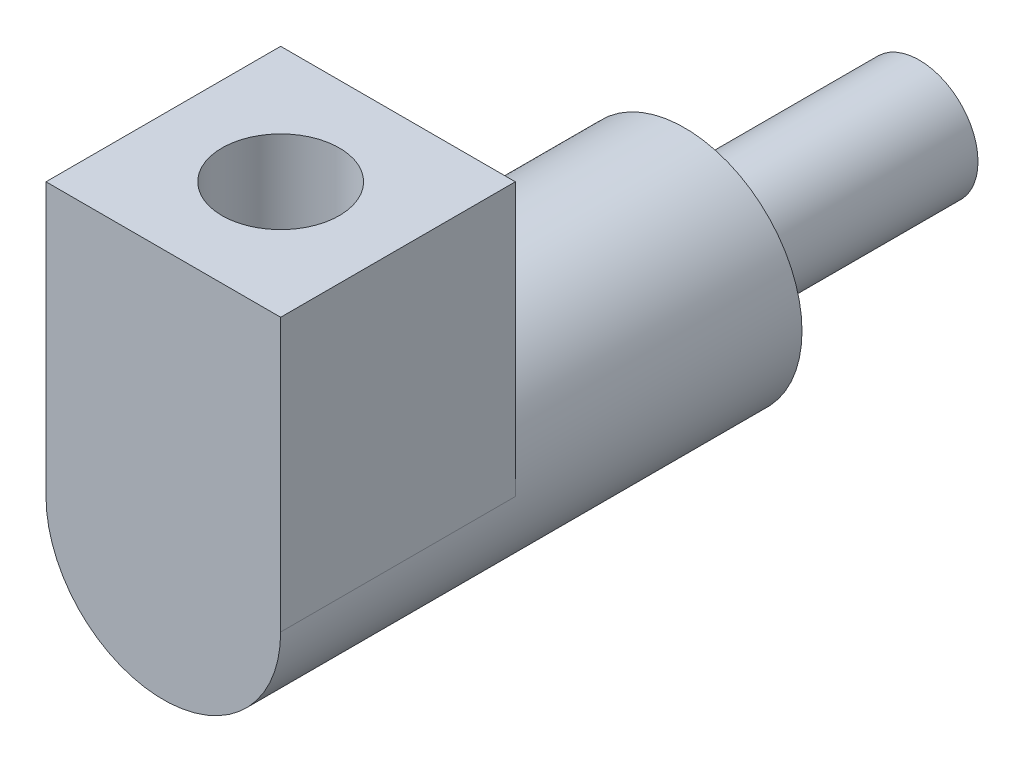
ISO-10303-21;
HEADER;
FILE_DESCRIPTION(('STEP AP214'),'2;1');
FILE_NAME('part.step','',(''),(''),'','','');
FILE_SCHEMA(('AUTOMOTIVE_DESIGN { 1 0 10303 214 1 1 1 1 }'));
ENDSEC;
DATA;
#1=APPLICATION_CONTEXT('core data for automotive mechanical design processes');
#2=APPLICATION_PROTOCOL_DEFINITION('international standard','automotive_design',2000,#1);
#3=PRODUCT_CONTEXT('',#1,'mechanical');
#4=PRODUCT('Part','Part','',(#3));
#5=PRODUCT_RELATED_PRODUCT_CATEGORY('part','',(#4));
#6=PRODUCT_DEFINITION_FORMATION('','',#4);
#7=PRODUCT_DEFINITION_CONTEXT('part definition',#1,'design');
#8=PRODUCT_DEFINITION('design','',#6,#7);
#9=PRODUCT_DEFINITION_SHAPE('','',#8);
#10=(LENGTH_UNIT() NAMED_UNIT(*) SI_UNIT(.MILLI.,.METRE.));
#11=(NAMED_UNIT(*) PLANE_ANGLE_UNIT() SI_UNIT($,.RADIAN.));
#12=(NAMED_UNIT(*) SI_UNIT($,.STERADIAN.) SOLID_ANGLE_UNIT());
#13=UNCERTAINTY_MEASURE_WITH_UNIT(LENGTH_MEASURE(1.E-05),#10,'distance_accuracy_value','');
#14=(GEOMETRIC_REPRESENTATION_CONTEXT(3) GLOBAL_UNCERTAINTY_ASSIGNED_CONTEXT((#13)) GLOBAL_UNIT_ASSIGNED_CONTEXT((#10,
#11,#12)) REPRESENTATION_CONTEXT('',''));
#15=CARTESIAN_POINT('',(0.,0.,0.));
#16=DIRECTION('',(0.,0.,1.));
#17=DIRECTION('',(1.,0.,0.));
#18=AXIS2_PLACEMENT_3D('',#15,#16,#17);
#19=CARTESIAN_POINT('',(0.,0.,30.));
#20=DIRECTION('',(0.,0.,-1.));
#21=DIRECTION('',(-1.,0.,0.));
#22=AXIS2_PLACEMENT_3D('',#19,#20,#21);
#23=CYLINDRICAL_SURFACE('',#22,15.);
#24=CARTESIAN_POINT('',(0.,0.,30.));
#25=DIRECTION('',(0.,0.,1.));
#26=DIRECTION('',(1.,0.,0.));
#27=AXIS2_PLACEMENT_3D('',#24,#25,#26);
#28=CIRCLE('',#27,15.);
#29=CARTESIAN_POINT('',(15.,0.,30.));
#30=VERTEX_POINT('',#29);
#31=EDGE_CURVE('E11',#30,#30,#28,.T.);
#32=ORIENTED_EDGE('',*,*,#31,.F.);
#33=EDGE_LOOP('',(#32));
#34=FACE_BOUND('',#33,.T.);
#35=CARTESIAN_POINT('',(0.,0.,-30.));
#36=DIRECTION('',(0.,0.,1.));
#37=DIRECTION('',(1.,0.,0.));
#38=AXIS2_PLACEMENT_3D('',#35,#36,#37);
#39=CIRCLE('',#38,15.);
#40=CARTESIAN_POINT('',(15.,0.,-30.));
#41=VERTEX_POINT('',#40);
#42=EDGE_CURVE('E37',#41,#41,#39,.T.);
#43=ORIENTED_EDGE('',*,*,#42,.T.);
#44=EDGE_LOOP('',(#43));
#45=FACE_BOUND('',#44,.T.);
#46=ADVANCED_FACE('F34',(#34,#45),#23,.T.);
#47=CARTESIAN_POINT('',(0.,0.,-30.));
#48=DIRECTION('',(0.,0.,1.));
#49=DIRECTION('',(1.,0.,0.));
#50=AXIS2_PLACEMENT_3D('',#47,#48,#49);
#51=PLANE('',#50);
#52=ORIENTED_EDGE('',*,*,#42,.F.);
#53=EDGE_LOOP('',(#52));
#54=FACE_BOUND('',#53,.T.);
#55=ADVANCED_FACE('F127',(#54),#51,.F.);
#56=CARTESIAN_POINT('',(0.,0.,103.3));
#57=DIRECTION('',(0.,0.,-1.));
#58=DIRECTION('',(-1.,0.,0.));
#59=AXIS2_PLACEMENT_3D('',#56,#57,#58);
#60=CYLINDRICAL_SURFACE('',#59,30.);
#61=CARTESIAN_POINT('',(0.,0.,103.3));
#62=DIRECTION('',(0.,0.,1.));
#63=DIRECTION('',(1.,0.,0.));
#64=AXIS2_PLACEMENT_3D('',#61,#62,#63);
#65=CIRCLE('',#64,30.);
#66=CARTESIAN_POINT('',(30.,0.,103.3));
#67=VERTEX_POINT('',#66);
#68=CARTESIAN_POINT('',(-30.,0.,103.3));
#69=VERTEX_POINT('',#68);
#70=EDGE_CURVE('E48',#67,#69,#65,.T.);
#71=ORIENTED_EDGE('',*,*,#70,.F.);
#72=DIRECTION('',(0.,0.,-1.));
#73=VECTOR('',#72,1.);
#74=CARTESIAN_POINT('',(30.,0.,163.3));
#75=LINE('',#74,#73);
#76=CARTESIAN_POINT('',(30.,0.,163.3));
#77=VERTEX_POINT('',#76);
#78=EDGE_CURVE('E93',#77,#67,#75,.T.);
#79=ORIENTED_EDGE('',*,*,#78,.F.);
#80=CARTESIAN_POINT('',(0.,0.,163.3));
#81=DIRECTION('',(0.,0.,1.));
#82=DIRECTION('',(-1.,0.,0.));
#83=AXIS2_PLACEMENT_3D('',#80,#81,#82);
#84=CIRCLE('',#83,30.);
#85=CARTESIAN_POINT('',(-30.,0.,163.3));
#86=VERTEX_POINT('',#85);
#87=EDGE_CURVE('E87',#86,#77,#84,.T.);
#88=ORIENTED_EDGE('',*,*,#87,.F.);
#89=DIRECTION('',(0.,0.,-1.));
#90=VECTOR('',#89,1.);
#91=CARTESIAN_POINT('',(-30.,0.,163.3));
#92=LINE('',#91,#90);
#93=EDGE_CURVE('E98',#86,#69,#92,.T.);
#94=ORIENTED_EDGE('',*,*,#93,.T.);
#95=EDGE_LOOP('',(#71,#79,#88,#94));
#96=FACE_BOUND('',#95,.T.);
#97=CARTESIAN_POINT('',(0.,0.,30.));
#98=DIRECTION('',(0.,0.,1.));
#99=DIRECTION('',(1.,0.,0.));
#100=AXIS2_PLACEMENT_3D('',#97,#98,#99);
#101=CIRCLE('',#100,30.);
#102=CARTESIAN_POINT('',(30.,0.,30.));
#103=VERTEX_POINT('',#102);
#104=EDGE_CURVE('E111',#103,#103,#101,.T.);
#105=ORIENTED_EDGE('',*,*,#104,.T.);
#106=EDGE_LOOP('',(#105));
#107=FACE_BOUND('',#106,.T.);
#108=ADVANCED_FACE('F116',(#96,#107),#60,.T.);
#109=CARTESIAN_POINT('',(0.,0.,30.));
#110=DIRECTION('',(0.,0.,1.));
#111=DIRECTION('',(1.,0.,0.));
#112=AXIS2_PLACEMENT_3D('',#109,#110,#111);
#113=PLANE('',#112);
#114=ORIENTED_EDGE('',*,*,#31,.T.);
#115=EDGE_LOOP('',(#114));
#116=FACE_BOUND('',#115,.T.);
#117=ORIENTED_EDGE('',*,*,#104,.F.);
#118=EDGE_LOOP('',(#117));
#119=FACE_BOUND('',#118,.T.);
#120=ADVANCED_FACE('F118',(#116,#119),#113,.F.);
#121=CARTESIAN_POINT('',(30.,0.,163.3));
#122=DIRECTION('',(-1.,0.,0.));
#123=DIRECTION('',(0.,0.,1.));
#124=AXIS2_PLACEMENT_3D('',#121,#122,#123);
#125=PLANE('',#124);
#126=DIRECTION('',(0.,1.,0.));
#127=VECTOR('',#126,1.);
#128=CARTESIAN_POINT('',(30.,0.,103.3));
#129=LINE('',#128,#127);
#130=CARTESIAN_POINT('',(30.,69.7,103.3));
#131=VERTEX_POINT('',#130);
#132=EDGE_CURVE('E92',#67,#131,#129,.T.);
#133=ORIENTED_EDGE('',*,*,#132,.T.);
#134=DIRECTION('',(0.,0.,-1.));
#135=VECTOR('',#134,1.);
#136=CARTESIAN_POINT('',(30.,69.7,163.3));
#137=LINE('',#136,#135);
#138=CARTESIAN_POINT('',(30.,69.7,163.3));
#139=VERTEX_POINT('',#138);
#140=EDGE_CURVE('E90',#139,#131,#137,.T.);
#141=ORIENTED_EDGE('',*,*,#140,.F.);
#142=DIRECTION('',(0.,1.,0.));
#143=VECTOR('',#142,1.);
#144=CARTESIAN_POINT('',(30.,0.,163.3));
#145=LINE('',#144,#143);
#146=EDGE_CURVE('E82',#77,#139,#145,.T.);
#147=ORIENTED_EDGE('',*,*,#146,.F.);
#148=ORIENTED_EDGE('',*,*,#78,.T.);
#149=EDGE_LOOP('',(#133,#141,#147,#148));
#150=FACE_BOUND('',#149,.T.);
#151=ADVANCED_FACE('F91',(#150),#125,.F.);
#152=CARTESIAN_POINT('',(-30.,69.7,163.3));
#153=DIRECTION('',(0.,-1.,0.));
#154=DIRECTION('',(0.,0.,-1.));
#155=AXIS2_PLACEMENT_3D('',#152,#153,#154);
#156=PLANE('',#155);
#157=CARTESIAN_POINT('',(0.,69.7,133.3));
#158=DIRECTION('',(0.,1.,0.));
#159=DIRECTION('',(0.,0.,1.));
#160=AXIS2_PLACEMENT_3D('',#157,#158,#159);
#161=CIRCLE('',#160,15.);
#162=CARTESIAN_POINT('',(0.,69.7,148.3));
#163=VERTEX_POINT('',#162);
#164=EDGE_CURVE('E249',#163,#163,#161,.T.);
#165=ORIENTED_EDGE('',*,*,#164,.F.);
#166=EDGE_LOOP('',(#165));
#167=FACE_BOUND('',#166,.T.);
#168=DIRECTION('',(-1.,0.,0.));
#169=VECTOR('',#168,1.);
#170=CARTESIAN_POINT('',(-30.,69.7,103.3));
#171=LINE('',#170,#169);
#172=CARTESIAN_POINT('',(-30.,69.7,103.3));
#173=VERTEX_POINT('',#172);
#174=EDGE_CURVE('E74',#131,#173,#171,.T.);
#175=ORIENTED_EDGE('',*,*,#174,.T.);
#176=DIRECTION('',(0.,0.,-1.));
#177=VECTOR('',#176,1.);
#178=CARTESIAN_POINT('',(-30.,69.7,163.3));
#179=LINE('',#178,#177);
#180=CARTESIAN_POINT('',(-30.,69.7,163.3));
#181=VERTEX_POINT('',#180);
#182=EDGE_CURVE('E94',#181,#173,#179,.T.);
#183=ORIENTED_EDGE('',*,*,#182,.F.);
#184=DIRECTION('',(-1.,0.,0.));
#185=VECTOR('',#184,1.);
#186=CARTESIAN_POINT('',(-30.,69.7,163.3));
#187=LINE('',#186,#185);
#188=EDGE_CURVE('E85',#139,#181,#187,.T.);
#189=ORIENTED_EDGE('',*,*,#188,.F.);
#190=ORIENTED_EDGE('',*,*,#140,.T.);
#191=EDGE_LOOP('',(#175,#183,#189,#190));
#192=FACE_BOUND('',#191,.T.);
#193=ADVANCED_FACE('F96',(#167,#192),#156,.F.);
#194=CARTESIAN_POINT('',(-30.,0.,163.3));
#195=DIRECTION('',(1.,0.,0.));
#196=DIRECTION('',(0.,0.,-1.));
#197=AXIS2_PLACEMENT_3D('',#194,#195,#196);
#198=PLANE('',#197);
#199=DIRECTION('',(0.,-1.,0.));
#200=VECTOR('',#199,1.);
#201=CARTESIAN_POINT('',(-30.,0.,103.3));
#202=LINE('',#201,#200);
#203=EDGE_CURVE('E105',#173,#69,#202,.T.);
#204=ORIENTED_EDGE('',*,*,#203,.T.);
#205=ORIENTED_EDGE('',*,*,#93,.F.);
#206=DIRECTION('',(0.,-1.,0.));
#207=VECTOR('',#206,1.);
#208=CARTESIAN_POINT('',(-30.,0.,163.3));
#209=LINE('',#208,#207);
#210=EDGE_CURVE('E57',#181,#86,#209,.T.);
#211=ORIENTED_EDGE('',*,*,#210,.F.);
#212=ORIENTED_EDGE('',*,*,#182,.T.);
#213=EDGE_LOOP('',(#204,#205,#211,#212));
#214=FACE_BOUND('',#213,.T.);
#215=ADVANCED_FACE('F165',(#214),#198,.F.);
#216=CARTESIAN_POINT('',(0.,0.,163.3));
#217=DIRECTION('',(0.,0.,-1.));
#218=DIRECTION('',(-1.,0.,0.));
#219=AXIS2_PLACEMENT_3D('',#216,#217,#218);
#220=PLANE('',#219);
#221=ORIENTED_EDGE('',*,*,#87,.T.);
#222=ORIENTED_EDGE('',*,*,#146,.T.);
#223=ORIENTED_EDGE('',*,*,#188,.T.);
#224=ORIENTED_EDGE('',*,*,#210,.T.);
#225=EDGE_LOOP('',(#221,#222,#223,#224));
#226=FACE_BOUND('',#225,.T.);
#227=ADVANCED_FACE('F83',(#226),#220,.F.);
#228=CARTESIAN_POINT('',(0.,0.,103.3));
#229=DIRECTION('',(0.,0.,-1.));
#230=DIRECTION('',(-1.,0.,0.));
#231=AXIS2_PLACEMENT_3D('',#228,#229,#230);
#232=PLANE('',#231);
#233=ORIENTED_EDGE('',*,*,#132,.F.);
#234=ORIENTED_EDGE('',*,*,#70,.T.);
#235=ORIENTED_EDGE('',*,*,#203,.F.);
#236=ORIENTED_EDGE('',*,*,#174,.F.);
#237=EDGE_LOOP('',(#233,#234,#235,#236));
#238=FACE_BOUND('',#237,.T.);
#239=ADVANCED_FACE('F164',(#238),#232,.T.);
#240=CARTESIAN_POINT('',(0.,39.7,133.3));
#241=DIRECTION('',(0.,1.,0.));
#242=DIRECTION('',(0.,0.,1.));
#243=AXIS2_PLACEMENT_3D('',#240,#241,#242);
#244=CYLINDRICAL_SURFACE('',#243,15.);
#245=CARTESIAN_POINT('',(0.,39.7,133.3));
#246=DIRECTION('',(0.,1.,0.));
#247=DIRECTION('',(0.,0.,1.));
#248=AXIS2_PLACEMENT_3D('',#245,#246,#247);
#249=CIRCLE('',#248,15.);
#250=CARTESIAN_POINT('',(0.,39.7,148.3));
#251=VERTEX_POINT('',#250);
#252=EDGE_CURVE('E103',#251,#251,#249,.T.);
#253=ORIENTED_EDGE('',*,*,#252,.F.);
#254=EDGE_LOOP('',(#253));
#255=FACE_BOUND('',#254,.T.);
#256=ORIENTED_EDGE('',*,*,#164,.T.);
#257=EDGE_LOOP('',(#256));
#258=FACE_BOUND('',#257,.T.);
#259=ADVANCED_FACE('F182',(#255,#258),#244,.F.);
#260=CARTESIAN_POINT('',(0.,39.7,133.3));
#261=DIRECTION('',(0.,1.,0.));
#262=DIRECTION('',(0.,0.,1.));
#263=AXIS2_PLACEMENT_3D('',#260,#261,#262);
#264=PLANE('',#263);
#265=ORIENTED_EDGE('',*,*,#252,.T.);
#266=EDGE_LOOP('',(#265));
#267=FACE_BOUND('',#266,.T.);
#268=ADVANCED_FACE('F199',(#267),#264,.T.);
#269=CLOSED_SHELL('',(#46,#55,#108,#120,#151,#193,#215,#227,#239,#259,#268));
#270=MANIFOLD_SOLID_BREP('B2',#269);
#271=ADVANCED_BREP_SHAPE_REPRESENTATION('',(#18,#270),#14);
#272=SHAPE_DEFINITION_REPRESENTATION(#9,#271);
ENDSEC;
END-ISO-10303-21;
